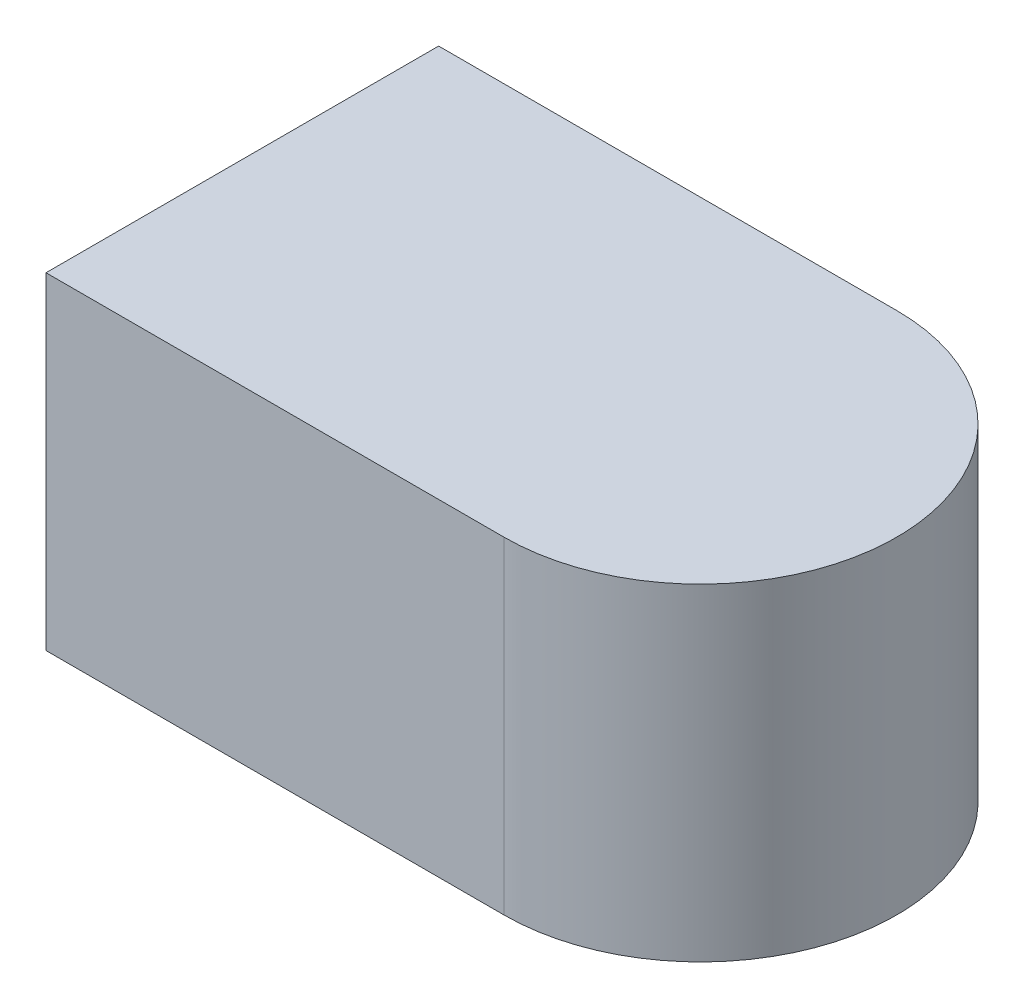
ISO-10303-21;
HEADER;
FILE_DESCRIPTION(('STEP AP214'),'2;1');
FILE_NAME('part.step','',(''),(''),'','','');
FILE_SCHEMA(('AUTOMOTIVE_DESIGN { 1 0 10303 214 1 1 1 1 }'));
ENDSEC;
DATA;
#1=APPLICATION_CONTEXT('core data for automotive mechanical design processes');
#2=APPLICATION_PROTOCOL_DEFINITION('international standard','automotive_design',2000,#1);
#3=PRODUCT_CONTEXT('',#1,'mechanical');
#4=PRODUCT('Part','Part','',(#3));
#5=PRODUCT_RELATED_PRODUCT_CATEGORY('part','',(#4));
#6=PRODUCT_DEFINITION_FORMATION('','',#4);
#7=PRODUCT_DEFINITION_CONTEXT('part definition',#1,'design');
#8=PRODUCT_DEFINITION('design','',#6,#7);
#9=PRODUCT_DEFINITION_SHAPE('','',#8);
#10=(LENGTH_UNIT() NAMED_UNIT(*) SI_UNIT(.MILLI.,.METRE.));
#11=(NAMED_UNIT(*) PLANE_ANGLE_UNIT() SI_UNIT($,.RADIAN.));
#12=(NAMED_UNIT(*) SI_UNIT($,.STERADIAN.) SOLID_ANGLE_UNIT());
#13=UNCERTAINTY_MEASURE_WITH_UNIT(LENGTH_MEASURE(1.E-05),#10,'distance_accuracy_value','');
#14=(GEOMETRIC_REPRESENTATION_CONTEXT(3) GLOBAL_UNCERTAINTY_ASSIGNED_CONTEXT((#13)) GLOBAL_UNIT_ASSIGNED_CONTEXT((#10,
#11,#12)) REPRESENTATION_CONTEXT('',''));
#15=CARTESIAN_POINT('',(0.,0.,0.));
#16=DIRECTION('',(0.,0.,1.));
#17=DIRECTION('',(1.,0.,0.));
#18=AXIS2_PLACEMENT_3D('',#15,#16,#17);
#19=CARTESIAN_POINT('',(0.,0.,0.));
#20=DIRECTION('',(0.,-1.,0.));
#21=DIRECTION('',(-1.,0.,0.));
#22=AXIS2_PLACEMENT_3D('',#19,#20,#21);
#23=PLANE('',#22);
#24=CARTESIAN_POINT('',(-1.47,0.,0.75));
#25=DIRECTION('',(0.,-1.,0.));
#26=DIRECTION('',(0.,0.,-1.));
#27=AXIS2_PLACEMENT_3D('',#24,#25,#26);
#28=CIRCLE('',#27,0.12);
#29=CARTESIAN_POINT('',(-1.47,0.,0.63));
#30=VERTEX_POINT('',#29);
#31=CARTESIAN_POINT('',(-1.47,0.,0.87));
#32=VERTEX_POINT('',#31);
#33=EDGE_CURVE('E11',#30,#32,#28,.T.);
#34=ORIENTED_EDGE('',*,*,#33,.T.);
#35=DIRECTION('',(-1.,0.,0.));
#36=VECTOR('',#35,1.);
#37=CARTESIAN_POINT('',(-1.47,0.,0.87));
#38=LINE('',#37,#36);
#39=CARTESIAN_POINT('',(-1.75,0.,0.87));
#40=VERTEX_POINT('',#39);
#41=EDGE_CURVE('E24',#32,#40,#38,.T.);
#42=ORIENTED_EDGE('',*,*,#41,.T.);
#43=DIRECTION('',(0.,0.,-1.));
#44=VECTOR('',#43,1.);
#45=CARTESIAN_POINT('',(-1.75,0.,0.87));
#46=LINE('',#45,#44);
#47=CARTESIAN_POINT('',(-1.75,0.,0.63));
#48=VERTEX_POINT('',#47);
#49=EDGE_CURVE('E62',#40,#48,#46,.T.);
#50=ORIENTED_EDGE('',*,*,#49,.T.);
#51=DIRECTION('',(1.,0.,0.));
#52=VECTOR('',#51,1.);
#53=CARTESIAN_POINT('',(-1.75,0.,0.63));
#54=LINE('',#53,#52);
#55=EDGE_CURVE('E36',#48,#30,#54,.T.);
#56=ORIENTED_EDGE('',*,*,#55,.T.);
#57=EDGE_LOOP('',(#34,#42,#50,#56));
#58=FACE_BOUND('',#57,.T.);
#59=ADVANCED_FACE('F17',(#58),#23,.T.);
#60=CARTESIAN_POINT('',(-1.75,0.,0.63));
#61=DIRECTION('',(0.,0.,1.));
#62=DIRECTION('',(1.,0.,0.));
#63=AXIS2_PLACEMENT_3D('',#60,#61,#62);
#64=PLANE('',#63);
#65=DIRECTION('',(0.,1.,0.));
#66=VECTOR('',#65,1.);
#67=CARTESIAN_POINT('',(-1.75,0.,0.63));
#68=LINE('',#67,#66);
#69=CARTESIAN_POINT('',(-1.75,0.2,0.63));
#70=VERTEX_POINT('',#69);
#71=EDGE_CURVE('E84',#48,#70,#68,.T.);
#72=ORIENTED_EDGE('',*,*,#71,.T.);
#73=DIRECTION('',(1.,0.,0.));
#74=VECTOR('',#73,1.);
#75=CARTESIAN_POINT('',(-1.75,0.2,0.63));
#76=LINE('',#75,#74);
#77=CARTESIAN_POINT('',(-1.47,0.2,0.63));
#78=VERTEX_POINT('',#77);
#79=EDGE_CURVE('E74',#70,#78,#76,.T.);
#80=ORIENTED_EDGE('',*,*,#79,.T.);
#81=DIRECTION('',(0.,1.,0.));
#82=VECTOR('',#81,1.);
#83=CARTESIAN_POINT('',(-1.47,0.,0.63));
#84=LINE('',#83,#82);
#85=EDGE_CURVE('E81',#30,#78,#84,.T.);
#86=ORIENTED_EDGE('',*,*,#85,.F.);
#87=ORIENTED_EDGE('',*,*,#55,.F.);
#88=EDGE_LOOP('',(#72,#80,#86,#87));
#89=FACE_BOUND('',#88,.T.);
#90=ADVANCED_FACE('F91',(#89),#64,.F.);
#91=CARTESIAN_POINT('',(-1.47,0.,0.75));
#92=DIRECTION('',(0.,-1.,0.));
#93=DIRECTION('',(-1.,0.,0.));
#94=AXIS2_PLACEMENT_3D('',#91,#92,#93);
#95=CYLINDRICAL_SURFACE('',#94,0.12);
#96=ORIENTED_EDGE('',*,*,#85,.T.);
#97=CARTESIAN_POINT('',(-1.47,0.2,0.75));
#98=DIRECTION('',(0.,-1.,0.));
#99=DIRECTION('',(0.,0.,-1.));
#100=AXIS2_PLACEMENT_3D('',#97,#98,#99);
#101=CIRCLE('',#100,0.12);
#102=CARTESIAN_POINT('',(-1.47,0.2,0.87));
#103=VERTEX_POINT('',#102);
#104=EDGE_CURVE('E79',#78,#103,#101,.T.);
#105=ORIENTED_EDGE('',*,*,#104,.T.);
#106=DIRECTION('',(0.,1.,0.));
#107=VECTOR('',#106,1.);
#108=CARTESIAN_POINT('',(-1.47,0.,0.87));
#109=LINE('',#108,#107);
#110=EDGE_CURVE('E68',#32,#103,#109,.T.);
#111=ORIENTED_EDGE('',*,*,#110,.F.);
#112=ORIENTED_EDGE('',*,*,#33,.F.);
#113=EDGE_LOOP('',(#96,#105,#111,#112));
#114=FACE_BOUND('',#113,.T.);
#115=ADVANCED_FACE('F89',(#114),#95,.T.);
#116=CARTESIAN_POINT('',(-1.47,0.,0.87));
#117=DIRECTION('',(0.,0.,-1.));
#118=DIRECTION('',(-1.,0.,0.));
#119=AXIS2_PLACEMENT_3D('',#116,#117,#118);
#120=PLANE('',#119);
#121=ORIENTED_EDGE('',*,*,#110,.T.);
#122=DIRECTION('',(-1.,0.,0.));
#123=VECTOR('',#122,1.);
#124=CARTESIAN_POINT('',(-1.47,0.2,0.87));
#125=LINE('',#124,#123);
#126=CARTESIAN_POINT('',(-1.75,0.2,0.87));
#127=VERTEX_POINT('',#126);
#128=EDGE_CURVE('E63',#103,#127,#125,.T.);
#129=ORIENTED_EDGE('',*,*,#128,.T.);
#130=DIRECTION('',(0.,1.,0.));
#131=VECTOR('',#130,1.);
#132=CARTESIAN_POINT('',(-1.75,0.,0.87));
#133=LINE('',#132,#131);
#134=EDGE_CURVE('E56',#40,#127,#133,.T.);
#135=ORIENTED_EDGE('',*,*,#134,.F.);
#136=ORIENTED_EDGE('',*,*,#41,.F.);
#137=EDGE_LOOP('',(#121,#129,#135,#136));
#138=FACE_BOUND('',#137,.T.);
#139=ADVANCED_FACE('F66',(#138),#120,.F.);
#140=CARTESIAN_POINT('',(-1.75,0.,0.87));
#141=DIRECTION('',(1.,0.,0.));
#142=DIRECTION('',(0.,0.,-1.));
#143=AXIS2_PLACEMENT_3D('',#140,#141,#142);
#144=PLANE('',#143);
#145=ORIENTED_EDGE('',*,*,#134,.T.);
#146=DIRECTION('',(0.,0.,-1.));
#147=VECTOR('',#146,1.);
#148=CARTESIAN_POINT('',(-1.75,0.2,0.87));
#149=LINE('',#148,#147);
#150=EDGE_CURVE('E61',#127,#70,#149,.T.);
#151=ORIENTED_EDGE('',*,*,#150,.T.);
#152=ORIENTED_EDGE('',*,*,#71,.F.);
#153=ORIENTED_EDGE('',*,*,#49,.F.);
#154=EDGE_LOOP('',(#145,#151,#152,#153));
#155=FACE_BOUND('',#154,.T.);
#156=ADVANCED_FACE('F58',(#155),#144,.F.);
#157=CARTESIAN_POINT('',(0.,0.2,0.));
#158=DIRECTION('',(0.,-1.,0.));
#159=DIRECTION('',(-1.,0.,0.));
#160=AXIS2_PLACEMENT_3D('',#157,#158,#159);
#161=PLANE('',#160);
#162=ORIENTED_EDGE('',*,*,#150,.F.);
#163=ORIENTED_EDGE('',*,*,#128,.F.);
#164=ORIENTED_EDGE('',*,*,#104,.F.);
#165=ORIENTED_EDGE('',*,*,#79,.F.);
#166=EDGE_LOOP('',(#162,#163,#164,#165));
#167=FACE_BOUND('',#166,.T.);
#168=ADVANCED_FACE('F72',(#167),#161,.F.);
#169=CLOSED_SHELL('',(#59,#90,#115,#139,#156,#168));
#170=MANIFOLD_SOLID_BREP('B1',#169);
#171=ADVANCED_BREP_SHAPE_REPRESENTATION('',(#18,#170),#14);
#172=SHAPE_DEFINITION_REPRESENTATION(#9,#171);
ENDSEC;
END-ISO-10303-21;
